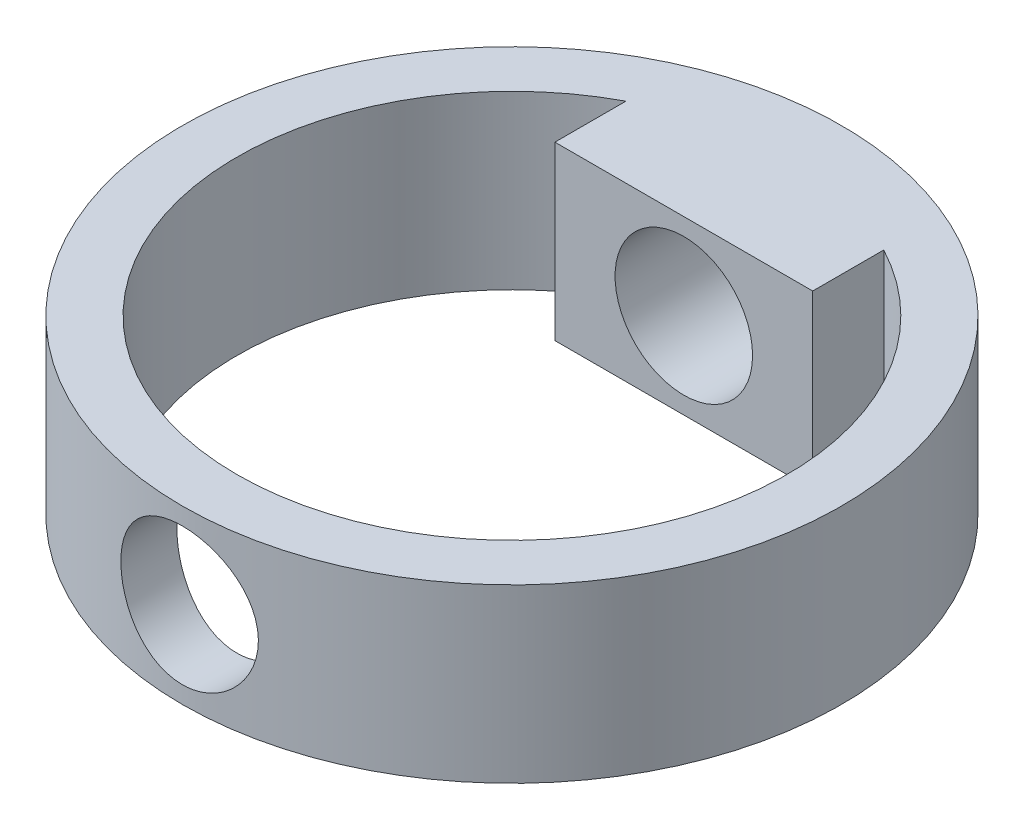
ISO-10303-21;
HEADER;
FILE_DESCRIPTION(('STEP AP214'),'2;1');
FILE_NAME('part.step','',(''),(''),'','','');
FILE_SCHEMA(('AUTOMOTIVE_DESIGN { 1 0 10303 214 1 1 1 1 }'));
ENDSEC;
DATA;
#1=APPLICATION_CONTEXT('core data for automotive mechanical design processes');
#2=APPLICATION_PROTOCOL_DEFINITION('international standard','automotive_design',2000,#1);
#3=PRODUCT_CONTEXT('',#1,'mechanical');
#4=PRODUCT('Part','Part','',(#3));
#5=PRODUCT_RELATED_PRODUCT_CATEGORY('part','',(#4));
#6=PRODUCT_DEFINITION_FORMATION('','',#4);
#7=PRODUCT_DEFINITION_CONTEXT('part definition',#1,'design');
#8=PRODUCT_DEFINITION('design','',#6,#7);
#9=PRODUCT_DEFINITION_SHAPE('','',#8);
#10=(LENGTH_UNIT() NAMED_UNIT(*) SI_UNIT(.MILLI.,.METRE.));
#11=(NAMED_UNIT(*) PLANE_ANGLE_UNIT() SI_UNIT($,.RADIAN.));
#12=(NAMED_UNIT(*) SI_UNIT($,.STERADIAN.) SOLID_ANGLE_UNIT());
#13=UNCERTAINTY_MEASURE_WITH_UNIT(LENGTH_MEASURE(1.E-05),#10,'distance_accuracy_value','');
#14=(GEOMETRIC_REPRESENTATION_CONTEXT(3) GLOBAL_UNCERTAINTY_ASSIGNED_CONTEXT((#13)) GLOBAL_UNIT_ASSIGNED_CONTEXT((#10,
#11,#12)) REPRESENTATION_CONTEXT('',''));
#15=CARTESIAN_POINT('',(0.,0.,0.));
#16=DIRECTION('',(0.,0.,1.));
#17=DIRECTION('',(1.,0.,0.));
#18=AXIS2_PLACEMENT_3D('',#15,#16,#17);
#19=CARTESIAN_POINT('',(0.,5.,0.));
#20=DIRECTION('',(0.,1.,0.));
#21=DIRECTION('',(0.,0.,1.));
#22=AXIS2_PLACEMENT_3D('',#19,#20,#21);
#23=PLANE('',#22);
#24=CARTESIAN_POINT('',(0.,5.,0.));
#25=DIRECTION('',(0.,1.,0.));
#26=DIRECTION('',(0.,0.,1.));
#27=AXIS2_PLACEMENT_3D('',#24,#25,#26);
#28=CIRCLE('',#27,19.175);
#29=CARTESIAN_POINT('',(0.,5.,19.175));
#30=VERTEX_POINT('',#29);
#31=EDGE_CURVE('E11',#30,#30,#28,.T.);
#32=ORIENTED_EDGE('',*,*,#31,.T.);
#33=EDGE_LOOP('',(#32));
#34=FACE_BOUND('',#33,.T.);
#35=CARTESIAN_POINT('',(0.,5.,0.));
#36=DIRECTION('',(0.,1.,0.));
#37=DIRECTION('',(0.,0.,1.));
#38=AXIS2_PLACEMENT_3D('',#35,#36,#37);
#39=CIRCLE('',#38,16.);
#40=CARTESIAN_POINT('',(-7.5,5.,-14.1332940251026));
#41=VERTEX_POINT('',#40);
#42=CARTESIAN_POINT('',(7.5,5.,-14.1332940251026));
#43=VERTEX_POINT('',#42);
#44=EDGE_CURVE('E120',#41,#43,#39,.T.);
#45=ORIENTED_EDGE('',*,*,#44,.F.);
#46=DIRECTION('',(0.,0.,1.));
#47=VECTOR('',#46,1.);
#48=CARTESIAN_POINT('',(-7.5,5.,-19.177));
#49=LINE('',#48,#47);
#50=CARTESIAN_POINT('',(-7.5,5.,-10.));
#51=VERTEX_POINT('',#50);
#52=EDGE_CURVE('E94',#41,#51,#49,.T.);
#53=ORIENTED_EDGE('',*,*,#52,.T.);
#54=DIRECTION('',(-1.,0.,0.));
#55=VECTOR('',#54,1.);
#56=CARTESIAN_POINT('',(-7.5,5.,-10.));
#57=LINE('',#56,#55);
#58=CARTESIAN_POINT('',(7.5,5.,-10.));
#59=VERTEX_POINT('',#58);
#60=EDGE_CURVE('E105',#59,#51,#57,.T.);
#61=ORIENTED_EDGE('',*,*,#60,.F.);
#62=DIRECTION('',(0.,0.,1.));
#63=VECTOR('',#62,1.);
#64=CARTESIAN_POINT('',(7.5,5.,-19.177));
#65=LINE('',#64,#63);
#66=EDGE_CURVE('E112',#43,#59,#65,.T.);
#67=ORIENTED_EDGE('',*,*,#66,.F.);
#68=EDGE_LOOP('',(#45,#53,#61,#67));
#69=FACE_BOUND('',#68,.T.);
#70=ADVANCED_FACE('F43',(#34,#69),#23,.T.);
#71=CARTESIAN_POINT('',(0.,-5.,0.));
#72=DIRECTION('',(0.,1.,0.));
#73=DIRECTION('',(0.,0.,1.));
#74=AXIS2_PLACEMENT_3D('',#71,#72,#73);
#75=PLANE('',#74);
#76=CARTESIAN_POINT('',(0.,-5.,0.));
#77=DIRECTION('',(0.,1.,0.));
#78=DIRECTION('',(0.,0.,1.));
#79=AXIS2_PLACEMENT_3D('',#76,#77,#78);
#80=CIRCLE('',#79,19.175);
#81=CARTESIAN_POINT('',(0.,-5.,19.175));
#82=VERTEX_POINT('',#81);
#83=EDGE_CURVE('E53',#82,#82,#80,.T.);
#84=ORIENTED_EDGE('',*,*,#83,.F.);
#85=EDGE_LOOP('',(#84));
#86=FACE_BOUND('',#85,.T.);
#87=CARTESIAN_POINT('',(0.,-5.,0.));
#88=DIRECTION('',(0.,1.,0.));
#89=DIRECTION('',(0.,0.,1.));
#90=AXIS2_PLACEMENT_3D('',#87,#88,#89);
#91=CIRCLE('',#90,16.);
#92=CARTESIAN_POINT('',(-7.5,-5.,-14.1332940251026));
#93=VERTEX_POINT('',#92);
#94=CARTESIAN_POINT('',(7.5,-5.,-14.1332940251026));
#95=VERTEX_POINT('',#94);
#96=EDGE_CURVE('E118',#93,#95,#91,.T.);
#97=ORIENTED_EDGE('',*,*,#96,.T.);
#98=DIRECTION('',(0.,0.,1.));
#99=VECTOR('',#98,1.);
#100=CARTESIAN_POINT('',(7.5,-5.,-19.177));
#101=LINE('',#100,#99);
#102=CARTESIAN_POINT('',(7.5,-5.,-10.));
#103=VERTEX_POINT('',#102);
#104=EDGE_CURVE('E69',#95,#103,#101,.T.);
#105=ORIENTED_EDGE('',*,*,#104,.T.);
#106=DIRECTION('',(1.,0.,0.));
#107=VECTOR('',#106,1.);
#108=CARTESIAN_POINT('',(-7.5,-5.,-10.));
#109=LINE('',#108,#107);
#110=CARTESIAN_POINT('',(-7.5,-5.,-10.));
#111=VERTEX_POINT('',#110);
#112=EDGE_CURVE('E97',#111,#103,#109,.T.);
#113=ORIENTED_EDGE('',*,*,#112,.F.);
#114=DIRECTION('',(0.,0.,1.));
#115=VECTOR('',#114,1.);
#116=CARTESIAN_POINT('',(-7.5,-5.,-19.177));
#117=LINE('',#116,#115);
#118=EDGE_CURVE('E61',#93,#111,#117,.T.);
#119=ORIENTED_EDGE('',*,*,#118,.F.);
#120=EDGE_LOOP('',(#97,#105,#113,#119));
#121=FACE_BOUND('',#120,.T.);
#122=ADVANCED_FACE('F98',(#86,#121),#75,.F.);
#123=CARTESIAN_POINT('',(0.,5.,0.));
#124=DIRECTION('',(0.,-1.,0.));
#125=DIRECTION('',(0.,0.,-1.));
#126=AXIS2_PLACEMENT_3D('',#123,#124,#125);
#127=CYLINDRICAL_SURFACE('',#126,19.175);
#128=CARTESIAN_POINT('',(0.,4.,-19.175));
#129=CARTESIAN_POINT('',(-0.222102329182371,3.99999208070985,-19.1749958888121));
#130=CARTESIAN_POINT('',(-0.444302747125869,3.98143897423728,-19.1711016820626));
#131=CARTESIAN_POINT('',(-0.88240902870243,3.90778379838054,-19.1559427648157));
#132=CARTESIAN_POINT('',(-1.09830998759571,3.85265400360543,-19.1446724632737));
#133=CARTESIAN_POINT('',(-1.51742096306219,3.7076337989503,-19.1160182204996));
#134=CARTESIAN_POINT('',(-1.72064339856049,3.61777804520765,-19.0986403760917));
#135=CARTESIAN_POINT('',(-2.10911701646481,3.40596277876463,-19.0596540716489));
#136=CARTESIAN_POINT('',(-2.29436899470486,3.28400468862731,-19.0380457990895));
#137=CARTESIAN_POINT('',(-2.64437172857825,3.00955141453294,-18.9926174417646));
#138=CARTESIAN_POINT('',(-2.80882097155036,2.85667587843284,-18.9687720155225));
#139=CARTESIAN_POINT('',(-3.10993771427849,2.52554444591537,-18.9217386125005));
#140=CARTESIAN_POINT('',(-3.24660291036288,2.34728644703193,-18.8985506903734));
#141=CARTESIAN_POINT('',(-3.48957658426812,1.96825414488877,-18.8552092336081));
#142=CARTESIAN_POINT('',(-3.59556891244262,1.76727312551538,-18.8350882470442));
#143=CARTESIAN_POINT('',(-3.77216160694428,1.34986450327282,-18.8005205172698));
#144=CARTESIAN_POINT('',(-3.8427657969152,1.13343857209489,-18.7860731610671));
#145=CARTESIAN_POINT('',(-3.94559123655194,0.694539861515234,-18.76474566481));
#146=CARTESIAN_POINT('',(-3.97834369222002,0.472196723222728,-18.757760903796));
#147=CARTESIAN_POINT('',(-4.00618670814569,0.0250700946072264,-18.7518348589192));
#148=CARTESIAN_POINT('',(-4.00128146654099,-0.199713120902312,-18.7528926784572));
#149=CARTESIAN_POINT('',(-3.9543769144673,-0.641424775241706,-18.7628373664398));
#150=CARTESIAN_POINT('',(-3.91299018386968,-0.858421611077921,-18.7715949380785));
#151=CARTESIAN_POINT('',(-3.79526601041652,-1.28232275573887,-18.7957484139725));
#152=CARTESIAN_POINT('',(-3.71892676673821,-1.48922654394192,-18.8111446602631));
#153=CARTESIAN_POINT('',(-3.53288975838323,-1.88881426907646,-18.8469707583388));
#154=CARTESIAN_POINT('',(-3.42295245907147,-2.08138332944593,-18.8674365477368));
#155=CARTESIAN_POINT('',(-3.17300879776667,-2.44556874689199,-18.9110731517028));
#156=CARTESIAN_POINT('',(-3.03299868999056,-2.61718248965364,-18.9342443030788));
#157=CARTESIAN_POINT('',(-2.72362061461269,-2.93811702054505,-18.9812385664599));
#158=CARTESIAN_POINT('',(-2.55373067136104,-3.08693451660719,-19.0050655517225));
#159=CARTESIAN_POINT('',(-2.19114144304724,-3.35404278640565,-19.0502716380839));
#160=CARTESIAN_POINT('',(-1.99844181408025,-3.47233309979382,-19.0716507022656));
#161=CARTESIAN_POINT('',(-1.59511942222168,-3.67513622672902,-19.1096119482556));
#162=CARTESIAN_POINT('',(-1.38446496014014,-3.75958773463566,-19.1261854088975));
#163=CARTESIAN_POINT('',(-0.95153427072354,-3.8917590486166,-19.1526025501856));
#164=CARTESIAN_POINT('',(-0.729259581614202,-3.93948370332009,-19.1624471191517));
#165=CARTESIAN_POINT('',(-0.283719412968972,-3.99612530230336,-19.1741723222952));
#166=CARTESIAN_POINT('',(-0.0605450285527821,-4.00573043459539,-19.1761941664688));
#167=CARTESIAN_POINT('',(0.384219458222078,-3.98771906260304,-19.1724399013091));
#168=CARTESIAN_POINT('',(0.605809657013779,-3.9601048436783,-19.1666642707598));
#169=CARTESIAN_POINT('',(1.0388685283773,-3.86900993849975,-19.1480527126279));
#170=CARTESIAN_POINT('',(1.25041550524671,-3.8058858902946,-19.1352870221664));
#171=CARTESIAN_POINT('',(1.65992082968633,-3.64595565520616,-19.1041225239045));
#172=CARTESIAN_POINT('',(1.85787809284669,-3.54914678412799,-19.0857232672041));
#173=CARTESIAN_POINT('',(2.23746169059404,-3.32313089149193,-19.0449821997002));
#174=CARTESIAN_POINT('',(2.41883865915188,-3.19351404386547,-19.0225916644571));
#175=CARTESIAN_POINT('',(2.75751460993939,-2.90610617678312,-18.9764592034133));
#176=CARTESIAN_POINT('',(2.91481076276608,-2.74831185129382,-18.9527171192596));
#177=CARTESIAN_POINT('',(3.20354533587637,-2.40588372561837,-18.906076128592));
#178=CARTESIAN_POINT('',(3.33450941390471,-2.22084665004464,-18.8831978535959));
#179=CARTESIAN_POINT('',(3.56350177056541,-1.83099758432252,-18.8413292042323));
#180=CARTESIAN_POINT('',(3.66153142207671,-1.62618641891979,-18.8223386678163));
#181=CARTESIAN_POINT('',(3.82124303799911,-1.20367011394067,-18.7905658475272));
#182=CARTESIAN_POINT('',(3.88312143687638,-0.986041866748258,-18.7777500798918));
#183=CARTESIAN_POINT('',(3.96936134148339,-0.543178267846513,-18.7597113980149));
#184=CARTESIAN_POINT('',(3.99372822989041,-0.317944012294856,-18.7544873944067));
#185=CARTESIAN_POINT('',(4.0040406600411,0.128966789928324,-18.7522879023347));
#186=CARTESIAN_POINT('',(3.99073683084177,0.350625558622321,-18.755151261692));
#187=CARTESIAN_POINT('',(3.92775175387388,0.78846993069448,-18.7684418320336));
#188=CARTESIAN_POINT('',(3.87807085722333,1.00465558687927,-18.7788689700109));
#189=CARTESIAN_POINT('',(3.74408943906801,1.42488609089922,-18.8060372118738));
#190=CARTESIAN_POINT('',(3.65988870620071,1.62896400874288,-18.8227601049374));
#191=CARTESIAN_POINT('',(3.45934721625093,2.0202112244699,-18.8606444642846));
#192=CARTESIAN_POINT('',(3.34300346600233,2.20737894551635,-18.8818063438836));
#193=CARTESIAN_POINT('',(3.07894801647437,2.56321383878539,-18.9266721141801));
#194=CARTESIAN_POINT('',(2.93069739408695,2.73147616230203,-18.9504156876447));
#195=CARTESIAN_POINT('',(2.60814017223037,3.04098244871902,-18.9974930609217));
#196=CARTESIAN_POINT('',(2.43382758171048,3.18222018222027,-19.0208267651328));
#197=CARTESIAN_POINT('',(2.06166768544869,3.43522110029815,-19.0647745311733));
#198=CARTESIAN_POINT('',(1.86357144845027,3.54662440971975,-19.0853540083681));
#199=CARTESIAN_POINT('',(1.45108781510336,3.73438060971954,-19.1211314917548));
#200=CARTESIAN_POINT('',(1.23671483924297,3.81076411356785,-19.1363341954936));
#201=CARTESIAN_POINT('',(0.851647108552352,3.91204575312839,-19.1567992309384));
#202=CARTESIAN_POINT('',(0.683097519319004,3.9449679647089,-19.1635835395372));
#203=CARTESIAN_POINT('',(0.343051387637878,3.98894774072555,-19.1726854289154));
#204=CARTESIAN_POINT('',(0.171554954845571,4.00000611697081,-19.1750031755392));
#205=CARTESIAN_POINT('',(0.,4.,-19.175));
#206=B_SPLINE_CURVE_WITH_KNOTS('',3,(#128,#129,#130,#131,#132,#133,#134,#135,#136,#137,#138,
#139,#140,#141,#142,#143,#144,#145,#146,#147,#148,#149,#150,#151,#152,#153,#154,#155,#156,#157,
#158,#159,#160,#161,#162,#163,#164,#165,#166,#167,#168,#169,#170,#171,#172,#173,#174,#175,#176,
#177,#178,#179,#180,#181,#182,#183,#184,#185,#186,#187,#188,#189,#190,#191,#192,#193,#194,#195,
#196,#197,#198,#199,#200,#201,#202,#203,#204,#205),.UNSPECIFIED.,.T.,.F.,(4,2,2,2,2,2,2,2,2,2,2,
2,2,2,2,2,2,2,2,2,2,2,2,2,2,2,2,2,2,2,2,2,2,2,2,2,2,2,4),(0.,0.665679228507844,1.3318636239989,
1.99738488431002,2.66287665808748,3.33711669397908,4.01141261066974,4.692429393058,
5.37337257656978,6.04463878792503,6.71583016658265,7.37596143910885,8.03612672673488,
8.70111297253063,9.36618209519518,10.0442962663982,10.7224206629262,11.4017681195893,
12.0810258743324,12.7479633516991,13.4148598793311,14.0751751286566,14.735543007645,
15.4046064674069,16.0737484793105,16.7540361163958,17.434295392019,18.1108231244707,
18.7872537701893,19.4503012168058,20.113342263653,20.7744799819329,21.4356792862914,
22.1090725444149,22.7826208389377,23.4639610144261,24.1447044416453,24.6589035089792,
25.1730834836274),.UNSPECIFIED.);
#207=CARTESIAN_POINT('',(0.,4.,-19.175));
#208=VERTEX_POINT('',#207);
#209=EDGE_CURVE('E111',#208,#208,#206,.T.);
#210=ORIENTED_EDGE('',*,*,#209,.T.);
#211=EDGE_LOOP('',(#210));
#212=FACE_BOUND('',#211,.T.);
#213=CARTESIAN_POINT('',(4.,0.,18.7531497354444));
#214=CARTESIAN_POINT('',(3.99999203651197,-0.222043057813255,18.7531542004749));
#215=CARTESIAN_POINT('',(3.98144849538739,-0.444184318640739,18.7571362338725));
#216=CARTESIAN_POINT('',(3.90783475419504,-0.882167784657174,18.7726080994832));
#217=CARTESIAN_POINT('',(3.85273659563942,-1.09800503625539,18.7841036782677));
#218=CARTESIAN_POINT('',(3.70780887369187,-1.51698105812959,18.8132453278449));
#219=CARTESIAN_POINT('',(3.61801545083395,-1.72013278741294,18.8308849967306));
#220=CARTESIAN_POINT('',(3.40634713510746,-2.10848710233083,18.8703196295442));
#221=CARTESIAN_POINT('',(3.28447352251308,-2.29369040385781,18.8921144276373));
#222=CARTESIAN_POINT('',(3.01010703882584,-2.6437446330328,18.9377779557781));
#223=CARTESIAN_POINT('',(2.85721483445231,-2.80827943049133,18.9616711553299));
#224=CARTESIAN_POINT('',(2.52601369841869,-3.10956228448878,19.008624479229));
#225=CARTESIAN_POINT('',(2.34770290145085,-3.24630829999905,19.0316845422818));
#226=CARTESIAN_POINT('',(1.96862090965664,-3.48936932841794,19.0746384361012));
#227=CARTESIAN_POINT('',(1.76765207100152,-3.5953822773755,19.0945000379449));
#228=CARTESIAN_POINT('',(1.35026976345734,-3.77201641124193,19.128543580501));
#229=CARTESIAN_POINT('',(1.13385787130802,-3.84264120340112,19.1427261000744));
#230=CARTESIAN_POINT('',(0.695016316365369,-3.94550554322123,19.1636405999331));
#231=CARTESIAN_POINT('',(0.472716935862695,-3.97827948066262,19.1704762078005));
#232=CARTESIAN_POINT('',(0.0256770351017311,-4.00618064209558,19.1762851085723));
#233=CARTESIAN_POINT('',(-0.199063227692279,-4.00131179886678,19.1752592228168));
#234=CARTESIAN_POINT('',(-0.640927955109861,-3.95446764137255,19.1655405302338));
#235=CARTESIAN_POINT('',(-0.858116461492015,-3.91306811775599,19.1569666977604));
#236=CARTESIAN_POINT('',(-1.28239421545113,-3.79525297327978,19.1332502518747));
#237=CARTESIAN_POINT('',(-1.48948303411459,-3.71883586672381,19.1181073597573));
#238=CARTESIAN_POINT('',(-1.88930564799468,-3.53263221381931,19.0827602932382));
#239=CARTESIAN_POINT('',(-2.08193283528819,-3.42262338516992,19.0625225669801));
#240=CARTESIAN_POINT('',(-2.44620475461158,-3.17252407111712,19.019211505818));
#241=CARTESIAN_POINT('',(-2.61784686735835,-3.03242983656248,18.9961378176585));
#242=CARTESIAN_POINT('',(-2.93869687886508,-2.72298838107001,18.949182481972));
#243=CARTESIAN_POINT('',(-3.0874181109363,-2.55313720595866,18.9252938092071));
#244=CARTESIAN_POINT('',(-3.35435012211023,-2.19066106459573,18.8798132804386));
#245=CARTESIAN_POINT('',(-3.47256021801376,-1.99803558852742,18.8582214758723));
#246=CARTESIAN_POINT('',(-3.67530379935702,-1.59474053277137,18.8197633470775));
#247=CARTESIAN_POINT('',(-3.75975260363555,-1.38402717095183,18.8029089363522));
#248=CARTESIAN_POINT('',(-3.89190082332115,-0.950967441154033,18.7760040328505));
#249=CARTESIAN_POINT('',(-3.93960549045443,-0.728622740460243,18.7659525677749));
#250=CARTESIAN_POINT('',(-3.9961716149487,-0.283038924882187,18.7539880196349));
#251=CARTESIAN_POINT('',(-4.00573847622337,-0.0598932261377082,18.7519271606953));
#252=CARTESIAN_POINT('',(-3.98766082183796,0.384805002538837,18.7557796162068));
#253=CARTESIAN_POINT('',(-3.96001861485297,0.606357630457184,18.7616924359229));
#254=CARTESIAN_POINT('',(-3.86891739569149,1.03917153506219,18.7806871101057));
#255=CARTESIAN_POINT('',(-3.80584048960161,1.25051690523378,18.7936924402747));
#256=CARTESIAN_POINT('',(-3.64607126686535,1.65963964996967,18.825338796959));
#257=CARTESIAN_POINT('',(-3.54937597644617,1.85741582239325,18.8439803220147));
#258=CARTESIAN_POINT('',(-3.32353723457161,2.23685744480654,18.8851273429681));
#259=CARTESIAN_POINT('',(-3.19395546702704,2.41825639839827,18.907683617093));
#260=CARTESIAN_POINT('',(-2.90660154399265,2.75699278957639,18.9539817472552));
#261=CARTESIAN_POINT('',(-2.74882621910602,2.91432751827318,18.9777237363691));
#262=CARTESIAN_POINT('',(-2.40638568515038,3.20317228608539,19.0242011697193));
#263=CARTESIAN_POINT('',(-2.22131291810081,3.33420357645403,19.0469129747689));
#264=CARTESIAN_POINT('',(-1.83137194007327,3.56331376249212,19.0883495188745));
#265=CARTESIAN_POINT('',(-1.62650460563071,3.66139411642197,19.1070744343589));
#266=CARTESIAN_POINT('',(-1.20400233315583,3.82113436284781,19.1383270229388));
#267=CARTESIAN_POINT('',(-0.986452685056026,3.88301227312955,19.1508917181623));
#268=CARTESIAN_POINT('',(-0.54375701927118,3.96927772818292,19.1685675457222));
#269=CARTESIAN_POINT('',(-0.318612005066421,3.99367020576386,19.1736796587594));
#270=CARTESIAN_POINT('',(0.128323267943924,4.0040674810687,19.1758484709114));
#271=CARTESIAN_POINT('',(0.350096413604126,3.99078977502952,19.1730557344373));
#272=CARTESIAN_POINT('',(0.788176558539512,3.92781708735097,19.1600479051391));
#273=CARTESIAN_POINT('',(1.00448363927946,3.87812264878834,19.1498329230016));
#274=CARTESIAN_POINT('',(1.42499579791006,3.74405748331409,19.1231357332298));
#275=CARTESIAN_POINT('',(1.62923173919128,3.65977999349854,19.1066703856688));
#276=CARTESIAN_POINT('',(2.02076370556084,3.45903544555652,19.0692386837355));
#277=CARTESIAN_POINT('',(2.2080582493317,3.3425655762054,19.0482719363107));
#278=CARTESIAN_POINT('',(2.56391735917136,3.07835830107088,19.0036762383571));
#279=CARTESIAN_POINT('',(2.7320987098272,2.93011144685468,18.98000726683));
#280=CARTESIAN_POINT('',(3.04144338545266,2.60759671415128,18.932902298433));
#281=CARTESIAN_POINT('',(3.18260025721028,2.43332263822956,18.9094663584725));
#282=CARTESIAN_POINT('',(3.43549769324441,2.06120589750029,18.8651717333674));
#283=CARTESIAN_POINT('',(3.54686768698878,1.8631071330899,18.8443470867529));
#284=CARTESIAN_POINT('',(3.73456093461146,1.45062148535814,18.8080538604756));
#285=CARTESIAN_POINT('',(3.81091503155155,1.23624913108331,18.792580570142));
#286=CARTESIAN_POINT('',(3.91212701267131,0.851256247300868,18.7717291125442));
#287=CARTESIAN_POINT('',(3.94501855033233,0.682785248665363,18.7648063822598));
#288=CARTESIAN_POINT('',(3.98895767706322,0.342895609755236,18.7555150617387));
#289=CARTESIAN_POINT('',(4.0000061499592,0.171477089027992,18.7531462872375));
#290=CARTESIAN_POINT('',(4.,0.,18.7531497354444));
#291=B_SPLINE_CURVE_WITH_KNOTS('',3,(#213,#214,#215,#216,#217,#218,#219,#220,#221,#222,#223,
#224,#225,#226,#227,#228,#229,#230,#231,#232,#233,#234,#235,#236,#237,#238,#239,#240,#241,#242,
#243,#244,#245,#246,#247,#248,#249,#250,#251,#252,#253,#254,#255,#256,#257,#258,#259,#260,#261,
#262,#263,#264,#265,#266,#267,#268,#269,#270,#271,#272,#273,#274,#275,#276,#277,#278,#279,#280,
#281,#282,#283,#284,#285,#286,#287,#288,#289,#290),.UNSPECIFIED.,.T.,.F.,(4,2,2,2,2,2,2,2,2,2,2,
2,2,2,2,2,2,2,2,2,2,2,2,2,2,2,2,2,2,2,2,2,2,2,2,2,2,2,4),(0.,0.665501055674938,1.33151170186577,
1.99683045617582,2.66212266259674,3.33659583126898,4.01111852071223,4.69206200173784,
5.37293605745931,6.04407505870745,6.71514394276211,7.37582079437291,8.03652567921657,
8.70170095361428,9.36695916827016,10.0448217553433,10.7226995196616,11.4022670490635,
12.0817374319416,12.7485802214409,13.4153816378974,14.0751270109482,14.7349307577803,
15.4040382038418,16.0732209154192,16.7536563881893,17.4340617439745,18.1103262359247,
18.7865017287815,19.4498851901653,20.1132587588223,20.7748554788731,21.436509991637,
22.1096932367905,22.7830370323307,23.4644044500311,24.1451705404665,24.6591375281773,
25.1730837190471),.UNSPECIFIED.);
#292=CARTESIAN_POINT('',(4.,0.,18.7531497354444));
#293=VERTEX_POINT('',#292);
#294=EDGE_CURVE('E152',#293,#293,#291,.T.);
#295=ORIENTED_EDGE('',*,*,#294,.T.);
#296=EDGE_LOOP('',(#295));
#297=FACE_BOUND('',#296,.T.);
#298=ORIENTED_EDGE('',*,*,#31,.F.);
#299=EDGE_LOOP('',(#298));
#300=FACE_BOUND('',#299,.T.);
#301=ORIENTED_EDGE('',*,*,#83,.T.);
#302=EDGE_LOOP('',(#301));
#303=FACE_BOUND('',#302,.T.);
#304=ADVANCED_FACE('F45',(#212,#297,#300,#303),#127,.T.);
#305=CARTESIAN_POINT('',(0.,5.,0.));
#306=DIRECTION('',(0.,-1.,0.));
#307=DIRECTION('',(0.,0.,-1.));
#308=AXIS2_PLACEMENT_3D('',#305,#306,#307);
#309=CYLINDRICAL_SURFACE('',#308,16.);
#310=CARTESIAN_POINT('',(4.,0.,15.4919333848297));
#311=CARTESIAN_POINT('',(3.99999372574892,-0.220881201482523,15.4919376014058));
#312=CARTESIAN_POINT('',(3.98164199279624,-0.441831837885635,15.4967088962336));
#313=CARTESIAN_POINT('',(3.90883700074207,-0.877388125077615,15.515229791881));
#314=CARTESIAN_POINT('',(3.85436273078737,-1.0919900071491,15.5289846179461));
#315=CARTESIAN_POINT('',(3.71118591941126,-1.50848566109949,15.5638195935384));
#316=CARTESIAN_POINT('',(3.62252756456719,-1.71039544861713,15.5848902830473));
#317=CARTESIAN_POINT('',(3.41363382601822,-2.09649736406381,15.6319710724601));
#318=CARTESIAN_POINT('',(3.2933971016971,-2.28068873932835,15.6579813820558));
#319=CARTESIAN_POINT('',(3.02193348369901,-2.63017863241954,15.71265146169));
#320=CARTESIAN_POINT('',(2.87013902032648,-2.79502976056007,15.7413535619685));
#321=CARTESIAN_POINT('',(2.54109130256106,-3.09721823097654,15.7978060082447));
#322=CARTESIAN_POINT('',(2.36383567068849,-3.23455300099479,15.8255562650622));
#323=CARTESIAN_POINT('',(1.98583232172633,-3.47964074821004,15.8774466483293));
#324=CARTESIAN_POINT('',(1.78479132191219,-3.58695422105834,15.9015309984095));
#325=CARTESIAN_POINT('',(1.36682109486842,-3.76609543064493,15.9428929908157));
#326=CARTESIAN_POINT('',(1.1498942172671,-3.83792840306482,15.9601716373495));
#327=CARTESIAN_POINT('',(0.710974014006659,-3.94263653532574,15.9856761415709));
#328=CARTESIAN_POINT('',(0.489172351278363,-3.97627143092253,15.994078301509));
#329=CARTESIAN_POINT('',(0.0429261108204306,-4.00601340684088,16.0014975057168));
#330=CARTESIAN_POINT('',(-0.181518071260913,-4.00212603553535,16.0005159375474));
#331=CARTESIAN_POINT('',(-0.621408988689545,-3.95748023959978,15.9894095192564));
#332=CARTESIAN_POINT('',(-0.836944862404252,-3.91754187991386,15.9794880374535));
#333=CARTESIAN_POINT('',(-1.25815298965476,-3.80324596792237,15.9518533843981));
#334=CARTESIAN_POINT('',(-1.46382471748181,-3.72888658339603,15.9341397983768));
#335=CARTESIAN_POINT('',(-1.86162681400717,-3.54719588690082,15.8926001552126));
#336=CARTESIAN_POINT('',(-2.0536180390658,-3.43957272854166,15.8687203151142));
#337=CARTESIAN_POINT('',(-2.41710248936217,-3.19463091341354,15.817438460961));
#338=CARTESIAN_POINT('',(-2.58859214034283,-3.05730709030133,15.7900358344647));
#339=CARTESIAN_POINT('',(-2.91109614033899,-2.75246601282993,15.7338194202868));
#340=CARTESIAN_POINT('',(-3.06143071629766,-2.5842321722501,15.7049875123183));
#341=CARTESIAN_POINT('',(-3.33190550385521,-2.22464004232906,15.6498406963637));
#342=CARTESIAN_POINT('',(-3.45204430419577,-2.03328067278998,15.6235259060557));
#343=CARTESIAN_POINT('',(-3.6591525160815,-1.63153594538063,15.5763279489438));
#344=CARTESIAN_POINT('',(-3.74595826784276,-1.42106283157905,15.5554717382566));
#345=CARTESIAN_POINT('',(-3.88274248250565,-0.987863251159867,15.5218982411655));
#346=CARTESIAN_POINT('',(-3.93272882620157,-0.765139417649982,15.5091792131627));
#347=CARTESIAN_POINT('',(-3.99332742187493,-0.320064797534446,15.4936856964321));
#348=CARTESIAN_POINT('',(-4.00494475827312,-0.0978595306496264,15.4906574237147));
#349=CARTESIAN_POINT('',(-3.99122718482172,0.34531509853167,15.4941974937513));
#350=CARTESIAN_POINT('',(-3.96589567655901,0.566284572717847,15.5007649531025));
#351=CARTESIAN_POINT('',(-3.87988074230187,0.996982823918956,15.5225133117816));
#352=CARTESIAN_POINT('',(-3.81978250925122,1.20683636251105,15.5375515238864));
#353=CARTESIAN_POINT('',(-3.66658893067256,1.61349033256499,15.574411492199));
#354=CARTESIAN_POINT('',(-3.57348967633996,1.81028921448916,15.5962340519409));
#355=CARTESIAN_POINT('',(-3.35483306869861,2.18950604458712,15.6447381935298));
#356=CARTESIAN_POINT('',(-3.22867480613704,2.37156614406879,15.6715066977164));
#357=CARTESIAN_POINT('',(-2.94824117173779,2.71230138048234,15.7266733291374));
#358=CARTESIAN_POINT('',(-2.79396117922175,2.87097266664016,15.7550717236528));
#359=CARTESIAN_POINT('',(-2.45705088393891,3.16449766811348,15.8111584485085));
#360=CARTESIAN_POINT('',(-2.27380781012637,3.29865610007809,15.8388112329901));
#361=CARTESIAN_POINT('',(-1.8868107307787,3.534297387122,15.889555465819));
#362=CARTESIAN_POINT('',(-1.68305779583036,3.63578194657313,15.9126471520632));
#363=CARTESIAN_POINT('',(-1.26223280692436,3.80231365524469,15.9515218518132));
#364=CARTESIAN_POINT('',(-1.04526952411153,3.8676228550065,15.9673572803586));
#365=CARTESIAN_POINT('',(-0.602999041275227,3.96073653537346,15.9901646943326));
#366=CARTESIAN_POINT('',(-0.377693460164961,3.98854825398246,15.9971383902947));
#367=CARTESIAN_POINT('',(0.068334105773294,4.00547035830216,16.0013667763522));
#368=CARTESIAN_POINT('',(0.289015307864089,3.99560683638163,15.9988791551995));
#369=CARTESIAN_POINT('',(0.725469985659005,3.9398086908226,15.9850358582977));
#370=CARTESIAN_POINT('',(0.941243607123716,3.89387513994732,15.9736804462868));
#371=CARTESIAN_POINT('',(1.3606841425791,3.76779112091655,15.9434173141556));
#372=CARTESIAN_POINT('',(1.56440997832345,3.68782618674249,15.9245505800957));
#373=CARTESIAN_POINT('',(1.9556682121665,3.49611768392171,15.8812515565463));
#374=CARTESIAN_POINT('',(2.14319856506253,3.38437010931806,15.8568185655503));
#375=CARTESIAN_POINT('',(2.50160771369321,3.12913906401547,15.8042899872115));
#376=CARTESIAN_POINT('',(2.67197995319334,2.98495942838468,15.7761206776666));
#377=CARTESIAN_POINT('',(2.98646008109402,2.67030859209061,15.7196259622876));
#378=CARTESIAN_POINT('',(3.13056130030636,2.49983073555535,15.6913005186921));
#379=CARTESIAN_POINT('',(3.39104810588733,2.13359434324216,15.6370990338201));
#380=CARTESIAN_POINT('',(3.50686647766551,1.93742350653898,15.6112785469316));
#381=CARTESIAN_POINT('',(3.70370758634188,1.52777804050072,15.5657582197931));
#382=CARTESIAN_POINT('',(3.78475563900861,1.31431613562461,15.5460539293285));
#383=CARTESIAN_POINT('',(3.89769011428401,0.917691952659357,15.5180763500295));
#384=CARTESIAN_POINT('',(3.93597268238751,0.736427342455453,15.50834652014));
#385=CARTESIAN_POINT('',(3.98712917028708,0.370124524009249,15.4952735433048));
#386=CARTESIAN_POINT('',(4.000005257487,0.185086639022391,15.4919298515643));
#387=CARTESIAN_POINT('',(4.,0.,15.4919333848297));
#388=B_SPLINE_CURVE_WITH_KNOTS('',3,(#310,#311,#312,#313,#314,#315,#316,#317,#318,#319,#320,
#321,#322,#323,#324,#325,#326,#327,#328,#329,#330,#331,#332,#333,#334,#335,#336,#337,#338,#339,
#340,#341,#342,#343,#344,#345,#346,#347,#348,#349,#350,#351,#352,#353,#354,#355,#356,#357,#358,
#359,#360,#361,#362,#363,#364,#365,#366,#367,#368,#369,#370,#371,#372,#373,#374,#375,#376,#377,
#378,#379,#380,#381,#382,#383,#384,#385,#386,#387),.UNSPECIFIED.,.T.,.F.,(4,2,2,2,2,2,2,2,2,2,2,
2,2,2,2,2,2,2,2,2,2,2,2,2,2,2,2,2,2,2,2,2,2,2,2,2,2,2,4),(0.,0.661963906777818,1.32431318628587,
1.98580916346563,2.64733322808766,3.32198326708762,3.99669634367786,4.68082394236672,
5.36485055755348,6.03502001592554,6.70509037865633,7.36029220302315,8.01552890759658,
8.67668598807111,9.33795816750261,10.0171274651506,10.6963284991968,11.3788229121533,
12.0611712021133,12.7254971962678,13.3897620350605,14.043158480267,14.6966323428624,
15.3629255338662,16.0293283022804,16.7124052955648,17.3954466516326,18.0734731650306,
18.7513687826643,19.410935138159,20.0704818781514,20.7264780250751,21.3825568919289,
22.0543535454328,22.7263205051678,23.4108236366987,24.0948275420408,24.6495652350122,
25.2042556017672),.UNSPECIFIED.);
#389=CARTESIAN_POINT('',(4.,0.,15.4919333848297));
#390=VERTEX_POINT('',#389);
#391=EDGE_CURVE('E145',#390,#390,#388,.T.);
#392=ORIENTED_EDGE('',*,*,#391,.F.);
#393=EDGE_LOOP('',(#392));
#394=FACE_BOUND('',#393,.T.);
#395=DIRECTION('',(0.,-1.,0.));
#396=VECTOR('',#395,1.);
#397=CARTESIAN_POINT('',(-7.5,5.,-14.1332940251026));
#398=LINE('',#397,#396);
#399=EDGE_CURVE('E92',#93,#41,#398,.F.);
#400=ORIENTED_EDGE('',*,*,#399,.T.);
#401=ORIENTED_EDGE('',*,*,#44,.T.);
#402=DIRECTION('',(0.,-1.,0.));
#403=VECTOR('',#402,1.);
#404=CARTESIAN_POINT('',(7.5,5.,-14.1332940251026));
#405=LINE('',#404,#403);
#406=EDGE_CURVE('E114',#43,#95,#405,.T.);
#407=ORIENTED_EDGE('',*,*,#406,.T.);
#408=ORIENTED_EDGE('',*,*,#96,.F.);
#409=EDGE_LOOP('',(#400,#401,#407,#408));
#410=FACE_BOUND('',#409,.T.);
#411=ADVANCED_FACE('F133',(#394,#410),#309,.F.);
#412=CARTESIAN_POINT('',(-7.5,5.,-19.177));
#413=DIRECTION('',(-1.,0.,0.));
#414=DIRECTION('',(0.,0.,1.));
#415=AXIS2_PLACEMENT_3D('',#412,#413,#414);
#416=PLANE('',#415);
#417=ORIENTED_EDGE('',*,*,#399,.F.);
#418=ORIENTED_EDGE('',*,*,#118,.T.);
#419=DIRECTION('',(0.,-1.,0.));
#420=VECTOR('',#419,1.);
#421=CARTESIAN_POINT('',(-7.5,5.,-10.));
#422=LINE('',#421,#420);
#423=EDGE_CURVE('E89',#51,#111,#422,.T.);
#424=ORIENTED_EDGE('',*,*,#423,.F.);
#425=ORIENTED_EDGE('',*,*,#52,.F.);
#426=EDGE_LOOP('',(#417,#418,#424,#425));
#427=FACE_BOUND('',#426,.T.);
#428=ADVANCED_FACE('F87',(#427),#416,.T.);
#429=CARTESIAN_POINT('',(0.,0.,-10.));
#430=DIRECTION('',(0.,0.,1.));
#431=DIRECTION('',(1.,0.,0.));
#432=AXIS2_PLACEMENT_3D('',#429,#430,#431);
#433=PLANE('',#432);
#434=CARTESIAN_POINT('',(0.,0.,-10.));
#435=DIRECTION('',(0.,0.,1.));
#436=DIRECTION('',(1.,0.,0.));
#437=AXIS2_PLACEMENT_3D('',#434,#435,#436);
#438=CIRCLE('',#437,4.);
#439=CARTESIAN_POINT('',(4.,0.,-10.));
#440=VERTEX_POINT('',#439);
#441=EDGE_CURVE('E48',#440,#440,#438,.T.);
#442=ORIENTED_EDGE('',*,*,#441,.F.);
#443=EDGE_LOOP('',(#442));
#444=FACE_BOUND('',#443,.T.);
#445=DIRECTION('',(0.,1.,0.));
#446=VECTOR('',#445,1.);
#447=CARTESIAN_POINT('',(7.5,5.,-10.));
#448=LINE('',#447,#446);
#449=EDGE_CURVE('E101',#103,#59,#448,.T.);
#450=ORIENTED_EDGE('',*,*,#449,.T.);
#451=ORIENTED_EDGE('',*,*,#60,.T.);
#452=ORIENTED_EDGE('',*,*,#423,.T.);
#453=ORIENTED_EDGE('',*,*,#112,.T.);
#454=EDGE_LOOP('',(#450,#451,#452,#453));
#455=FACE_BOUND('',#454,.T.);
#456=ADVANCED_FACE('F103',(#444,#455),#433,.T.);
#457=CARTESIAN_POINT('',(7.5,5.,-19.177));
#458=DIRECTION('',(1.,0.,0.));
#459=DIRECTION('',(0.,0.,-1.));
#460=AXIS2_PLACEMENT_3D('',#457,#458,#459);
#461=PLANE('',#460);
#462=ORIENTED_EDGE('',*,*,#406,.F.);
#463=ORIENTED_EDGE('',*,*,#66,.T.);
#464=ORIENTED_EDGE('',*,*,#449,.F.);
#465=ORIENTED_EDGE('',*,*,#104,.F.);
#466=EDGE_LOOP('',(#462,#463,#464,#465));
#467=FACE_BOUND('',#466,.T.);
#468=ADVANCED_FACE('F142',(#467),#461,.T.);
#469=CARTESIAN_POINT('',(0.,0.,-19.175));
#470=DIRECTION('',(0.,0.,1.));
#471=DIRECTION('',(1.,0.,0.));
#472=AXIS2_PLACEMENT_3D('',#469,#470,#471);
#473=CYLINDRICAL_SURFACE('',#472,4.);
#474=ORIENTED_EDGE('',*,*,#441,.T.);
#475=EDGE_LOOP('',(#474));
#476=FACE_BOUND('',#475,.T.);
#477=ORIENTED_EDGE('',*,*,#209,.F.);
#478=EDGE_LOOP('',(#477));
#479=FACE_BOUND('',#478,.T.);
#480=ADVANCED_FACE('F156',(#476,#479),#473,.F.);
#481=ORIENTED_EDGE('',*,*,#391,.T.);
#482=EDGE_LOOP('',(#481));
#483=FACE_BOUND('',#482,.T.);
#484=ORIENTED_EDGE('',*,*,#294,.F.);
#485=EDGE_LOOP('',(#484));
#486=FACE_BOUND('',#485,.T.);
#487=ADVANCED_FACE('F160',(#483,#486),#473,.F.);
#488=CLOSED_SHELL('',(#70,#122,#304,#411,#428,#456,#468,#480,#487));
#489=MANIFOLD_SOLID_BREP('B2',#488);
#490=ADVANCED_BREP_SHAPE_REPRESENTATION('',(#18,#489),#14);
#491=SHAPE_DEFINITION_REPRESENTATION(#9,#490);
ENDSEC;
END-ISO-10303-21;
